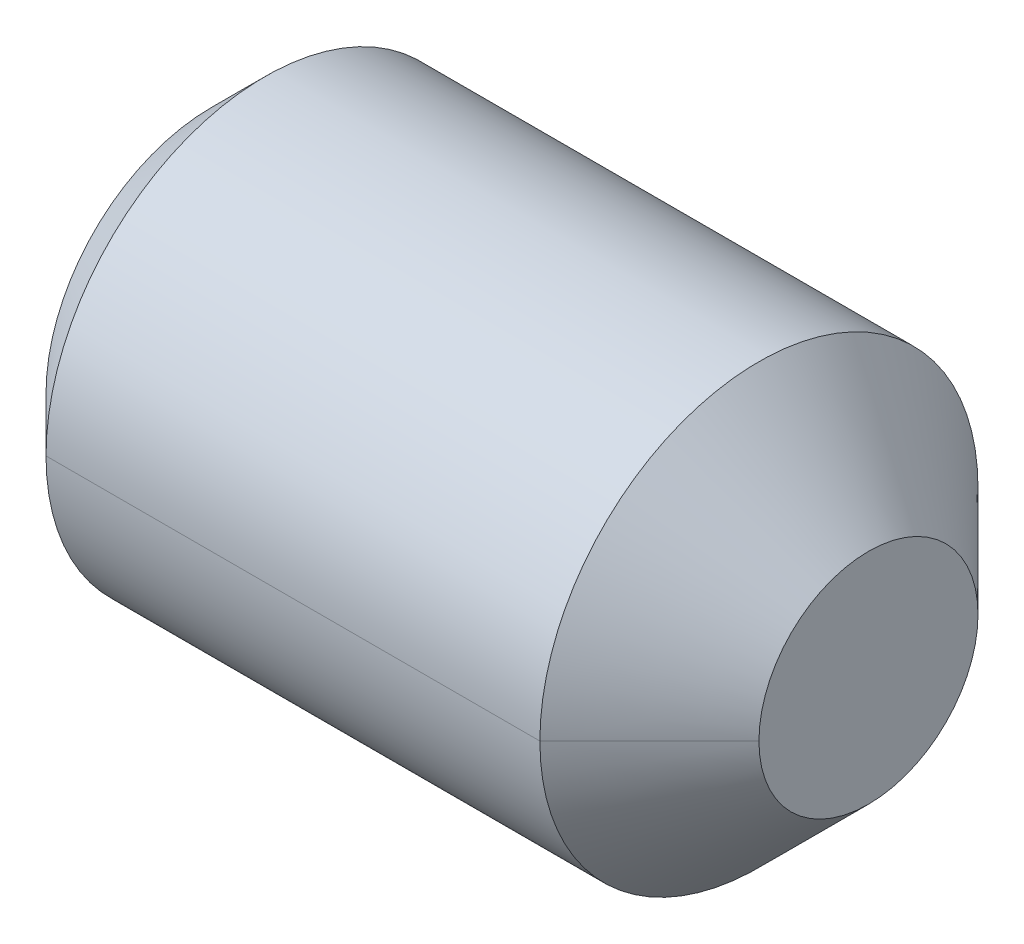
ISO-10303-21;
HEADER;
FILE_DESCRIPTION(('STEP AP214'),'2;1');
FILE_NAME('part.step','',(''),(''),'','','');
FILE_SCHEMA(('AUTOMOTIVE_DESIGN { 1 0 10303 214 1 1 1 1 }'));
ENDSEC;
DATA;
#1=APPLICATION_CONTEXT('core data for automotive mechanical design processes');
#2=APPLICATION_PROTOCOL_DEFINITION('international standard','automotive_design',2000,#1);
#3=PRODUCT_CONTEXT('',#1,'mechanical');
#4=PRODUCT('Part','Part','',(#3));
#5=PRODUCT_RELATED_PRODUCT_CATEGORY('part','',(#4));
#6=PRODUCT_DEFINITION_FORMATION('','',#4);
#7=PRODUCT_DEFINITION_CONTEXT('part definition',#1,'design');
#8=PRODUCT_DEFINITION('design','',#6,#7);
#9=PRODUCT_DEFINITION_SHAPE('','',#8);
#10=(LENGTH_UNIT() NAMED_UNIT(*) SI_UNIT(.MILLI.,.METRE.));
#11=(NAMED_UNIT(*) PLANE_ANGLE_UNIT() SI_UNIT($,.RADIAN.));
#12=(NAMED_UNIT(*) SI_UNIT($,.STERADIAN.) SOLID_ANGLE_UNIT());
#13=UNCERTAINTY_MEASURE_WITH_UNIT(LENGTH_MEASURE(1.E-05),#10,'distance_accuracy_value','');
#14=(GEOMETRIC_REPRESENTATION_CONTEXT(3) GLOBAL_UNCERTAINTY_ASSIGNED_CONTEXT((#13)) GLOBAL_UNIT_ASSIGNED_CONTEXT((#10,
#11,#12)) REPRESENTATION_CONTEXT('',''));
#15=CARTESIAN_POINT('',(0.,0.,0.));
#16=DIRECTION('',(0.,0.,1.));
#17=DIRECTION('',(1.,0.,0.));
#18=AXIS2_PLACEMENT_3D('',#15,#16,#17);
#19=CARTESIAN_POINT('',(-2.2,0.,0.));
#20=DIRECTION('',(-1.,0.,0.));
#21=DIRECTION('',(0.,0.,1.));
#22=AXIS2_PLACEMENT_3D('',#19,#20,#21);
#23=PLANE('',#22);
#24=DIRECTION('',(0.,0.866025403784439,0.499999999999999));
#25=VECTOR('',#24,1.);
#26=CARTESIAN_POINT('',(-2.2,-0.45,0.25980762113533));
#27=LINE('',#26,#25);
#28=CARTESIAN_POINT('',(-2.2,-0.45,0.25980762113533));
#29=VERTEX_POINT('',#28);
#30=CARTESIAN_POINT('',(-2.2,-0.225,0.389711431702996));
#31=VERTEX_POINT('',#30);
#32=EDGE_CURVE('E11',#29,#31,#27,.T.);
#33=ORIENTED_EDGE('',*,*,#32,.T.);
#34=CARTESIAN_POINT('',(-2.2,0.,0.));
#35=DIRECTION('',(1.,0.,0.));
#36=DIRECTION('',(0.,0.,1.));
#37=AXIS2_PLACEMENT_3D('',#34,#35,#36);
#38=CIRCLE('',#37,0.45);
#39=CARTESIAN_POINT('',(-2.2,-0.45,0.));
#40=VERTEX_POINT('',#39);
#41=EDGE_CURVE('E25',#31,#40,#38,.T.);
#42=ORIENTED_EDGE('',*,*,#41,.T.);
#43=DIRECTION('',(0.,0.,1.));
#44=VECTOR('',#43,1.);
#45=CARTESIAN_POINT('',(-2.2,-0.45,-0.25980762113533));
#46=LINE('',#45,#44);
#47=EDGE_CURVE('E333',#40,#29,#46,.T.);
#48=ORIENTED_EDGE('',*,*,#47,.T.);
#49=EDGE_LOOP('',(#33,#42,#48));
#50=FACE_BOUND('',#49,.T.);
#51=ADVANCED_FACE('F17',(#50),#23,.T.);
#52=CARTESIAN_POINT('',(-2.2,-0.45,-0.25980762113533));
#53=DIRECTION('',(0.,-1.,0.));
#54=DIRECTION('',(0.,0.,-1.));
#55=AXIS2_PLACEMENT_3D('',#52,#53,#54);
#56=PLANE('',#55);
#57=DIRECTION('',(0.,0.,1.));
#58=VECTOR('',#57,1.);
#59=CARTESIAN_POINT('',(-3.,-0.45,-0.25980762113533));
#60=LINE('',#59,#58);
#61=CARTESIAN_POINT('',(-3.,-0.45,-0.25980762113533));
#62=VERTEX_POINT('',#61);
#63=CARTESIAN_POINT('',(-3.,-0.45,0.25980762113533));
#64=VERTEX_POINT('',#63);
#65=EDGE_CURVE('E329',#62,#64,#60,.T.);
#66=ORIENTED_EDGE('',*,*,#65,.T.);
#67=DIRECTION('',(-1.,0.,0.));
#68=VECTOR('',#67,1.);
#69=CARTESIAN_POINT('',(-2.2,-0.45,0.25980762113533));
#70=LINE('',#69,#68);
#71=EDGE_CURVE('E324',#29,#64,#70,.T.);
#72=ORIENTED_EDGE('',*,*,#71,.F.);
#73=ORIENTED_EDGE('',*,*,#47,.F.);
#74=DIRECTION('',(0.,0.,1.));
#75=VECTOR('',#74,1.);
#76=CARTESIAN_POINT('',(-2.2,-0.45,-0.25980762113533));
#77=LINE('',#76,#75);
#78=CARTESIAN_POINT('',(-2.2,-0.45,-0.25980762113533));
#79=VERTEX_POINT('',#78);
#80=EDGE_CURVE('E319',#79,#40,#77,.T.);
#81=ORIENTED_EDGE('',*,*,#80,.F.);
#82=DIRECTION('',(-1.,0.,0.));
#83=VECTOR('',#82,1.);
#84=CARTESIAN_POINT('',(-2.2,-0.45,-0.25980762113533));
#85=LINE('',#84,#83);
#86=EDGE_CURVE('E315',#79,#62,#85,.T.);
#87=ORIENTED_EDGE('',*,*,#86,.T.);
#88=EDGE_LOOP('',(#66,#72,#73,#81,#87));
#89=FACE_BOUND('',#88,.T.);
#90=ADVANCED_FACE('F344',(#89),#56,.F.);
#91=CARTESIAN_POINT('',(-2.2,0.,-0.51961524227066));
#92=DIRECTION('',(0.,-0.499999999999999,-0.866025403784439));
#93=DIRECTION('',(0.,0.866025403784439,-0.499999999999999));
#94=AXIS2_PLACEMENT_3D('',#91,#92,#93);
#95=PLANE('',#94);
#96=DIRECTION('',(0.,-0.866025403784439,0.499999999999999));
#97=VECTOR('',#96,1.);
#98=CARTESIAN_POINT('',(-3.,0.,-0.51961524227066));
#99=LINE('',#98,#97);
#100=CARTESIAN_POINT('',(-3.,0.,-0.51961524227066));
#101=VERTEX_POINT('',#100);
#102=EDGE_CURVE('E310',#101,#62,#99,.T.);
#103=ORIENTED_EDGE('',*,*,#102,.T.);
#104=ORIENTED_EDGE('',*,*,#86,.F.);
#105=DIRECTION('',(0.,-0.866025403784439,0.499999999999999));
#106=VECTOR('',#105,1.);
#107=CARTESIAN_POINT('',(-2.2,0.,-0.51961524227066));
#108=LINE('',#107,#106);
#109=CARTESIAN_POINT('',(-2.2,-0.225,-0.389711431702998));
#110=VERTEX_POINT('',#109);
#111=EDGE_CURVE('E305',#110,#79,#108,.T.);
#112=ORIENTED_EDGE('',*,*,#111,.F.);
#113=DIRECTION('',(0.,-0.866025403784439,0.499999999999999));
#114=VECTOR('',#113,1.);
#115=CARTESIAN_POINT('',(-2.2,0.,-0.51961524227066));
#116=LINE('',#115,#114);
#117=CARTESIAN_POINT('',(-2.2,0.,-0.51961524227066));
#118=VERTEX_POINT('',#117);
#119=EDGE_CURVE('E300',#118,#110,#116,.T.);
#120=ORIENTED_EDGE('',*,*,#119,.F.);
#121=DIRECTION('',(-1.,0.,0.));
#122=VECTOR('',#121,1.);
#123=CARTESIAN_POINT('',(-2.2,0.,-0.51961524227066));
#124=LINE('',#123,#122);
#125=EDGE_CURVE('E296',#118,#101,#124,.T.);
#126=ORIENTED_EDGE('',*,*,#125,.T.);
#127=EDGE_LOOP('',(#103,#104,#112,#120,#126));
#128=FACE_BOUND('',#127,.T.);
#129=ADVANCED_FACE('F361',(#128),#95,.F.);
#130=CARTESIAN_POINT('',(-2.2,0.45,-0.25980762113533));
#131=DIRECTION('',(0.,0.499999999999999,-0.866025403784439));
#132=DIRECTION('',(0.,0.866025403784439,0.499999999999999));
#133=AXIS2_PLACEMENT_3D('',#130,#131,#132);
#134=PLANE('',#133);
#135=DIRECTION('',(0.,-0.866025403784439,-0.499999999999999));
#136=VECTOR('',#135,1.);
#137=CARTESIAN_POINT('',(-3.,0.45,-0.25980762113533));
#138=LINE('',#137,#136);
#139=CARTESIAN_POINT('',(-3.,0.45,-0.25980762113533));
#140=VERTEX_POINT('',#139);
#141=EDGE_CURVE('E291',#140,#101,#138,.T.);
#142=ORIENTED_EDGE('',*,*,#141,.T.);
#143=ORIENTED_EDGE('',*,*,#125,.F.);
#144=DIRECTION('',(0.,-0.866025403784439,-0.499999999999999));
#145=VECTOR('',#144,1.);
#146=CARTESIAN_POINT('',(-2.2,0.45,-0.25980762113533));
#147=LINE('',#146,#145);
#148=CARTESIAN_POINT('',(-2.2,0.225,-0.389711431702998));
#149=VERTEX_POINT('',#148);
#150=EDGE_CURVE('E286',#149,#118,#147,.T.);
#151=ORIENTED_EDGE('',*,*,#150,.F.);
#152=DIRECTION('',(0.,-0.866025403784439,-0.499999999999999));
#153=VECTOR('',#152,1.);
#154=CARTESIAN_POINT('',(-2.2,0.45,-0.25980762113533));
#155=LINE('',#154,#153);
#156=CARTESIAN_POINT('',(-2.2,0.45,-0.25980762113533));
#157=VERTEX_POINT('',#156);
#158=EDGE_CURVE('E281',#157,#149,#155,.T.);
#159=ORIENTED_EDGE('',*,*,#158,.F.);
#160=DIRECTION('',(-1.,0.,0.));
#161=VECTOR('',#160,1.);
#162=CARTESIAN_POINT('',(-2.2,0.45,-0.25980762113533));
#163=LINE('',#162,#161);
#164=EDGE_CURVE('E277',#157,#140,#163,.T.);
#165=ORIENTED_EDGE('',*,*,#164,.T.);
#166=EDGE_LOOP('',(#142,#143,#151,#159,#165));
#167=FACE_BOUND('',#166,.T.);
#168=ADVANCED_FACE('F383',(#167),#134,.F.);
#169=CARTESIAN_POINT('',(-2.2,0.45,0.25980762113533));
#170=DIRECTION('',(0.,1.,0.));
#171=DIRECTION('',(0.,0.,1.));
#172=AXIS2_PLACEMENT_3D('',#169,#170,#171);
#173=PLANE('',#172);
#174=DIRECTION('',(-1.,0.,0.));
#175=VECTOR('',#174,1.);
#176=CARTESIAN_POINT('',(-2.2,0.45,0.25980762113533));
#177=LINE('',#176,#175);
#178=CARTESIAN_POINT('',(-2.2,0.45,0.25980762113533));
#179=VERTEX_POINT('',#178);
#180=CARTESIAN_POINT('',(-3.,0.45,0.25980762113533));
#181=VERTEX_POINT('',#180);
#182=EDGE_CURVE('E273',#179,#181,#177,.T.);
#183=ORIENTED_EDGE('',*,*,#182,.T.);
#184=DIRECTION('',(0.,0.,1.));
#185=VECTOR('',#184,1.);
#186=CARTESIAN_POINT('',(-3.,0.45,0.));
#187=LINE('',#186,#185);
#188=EDGE_CURVE('E268',#140,#181,#187,.T.);
#189=ORIENTED_EDGE('',*,*,#188,.F.);
#190=ORIENTED_EDGE('',*,*,#164,.F.);
#191=DIRECTION('',(0.,0.,-1.));
#192=VECTOR('',#191,1.);
#193=CARTESIAN_POINT('',(-2.2,0.45,0.25980762113533));
#194=LINE('',#193,#192);
#195=CARTESIAN_POINT('',(-2.2,0.45,0.));
#196=VERTEX_POINT('',#195);
#197=EDGE_CURVE('E263',#196,#157,#194,.T.);
#198=ORIENTED_EDGE('',*,*,#197,.F.);
#199=DIRECTION('',(0.,0.,-1.));
#200=VECTOR('',#199,1.);
#201=CARTESIAN_POINT('',(-2.2,0.45,0.25980762113533));
#202=LINE('',#201,#200);
#203=EDGE_CURVE('E258',#179,#196,#202,.T.);
#204=ORIENTED_EDGE('',*,*,#203,.F.);
#205=EDGE_LOOP('',(#183,#189,#190,#198,#204));
#206=FACE_BOUND('',#205,.T.);
#207=ADVANCED_FACE('F386',(#206),#173,.F.);
#208=CARTESIAN_POINT('',(-2.2,0.,0.));
#209=DIRECTION('',(-1.,0.,0.));
#210=DIRECTION('',(0.,0.,1.));
#211=AXIS2_PLACEMENT_3D('',#208,#209,#210);
#212=PLANE('',#211);
#213=ORIENTED_EDGE('',*,*,#203,.T.);
#214=CARTESIAN_POINT('',(-2.2,0.,0.));
#215=DIRECTION('',(1.,0.,0.));
#216=DIRECTION('',(0.,0.,-1.));
#217=AXIS2_PLACEMENT_3D('',#214,#215,#216);
#218=CIRCLE('',#217,0.45);
#219=CARTESIAN_POINT('',(-2.2,0.225,0.389711431702998));
#220=VERTEX_POINT('',#219);
#221=EDGE_CURVE('E254',#196,#220,#218,.T.);
#222=ORIENTED_EDGE('',*,*,#221,.T.);
#223=DIRECTION('',(0.,0.866025403784439,-0.499999999999999));
#224=VECTOR('',#223,1.);
#225=CARTESIAN_POINT('',(-2.2,0.,0.51961524227066));
#226=LINE('',#225,#224);
#227=EDGE_CURVE('E249',#220,#179,#226,.T.);
#228=ORIENTED_EDGE('',*,*,#227,.T.);
#229=EDGE_LOOP('',(#213,#222,#228));
#230=FACE_BOUND('',#229,.T.);
#231=ADVANCED_FACE('F388',(#230),#212,.T.);
#232=CARTESIAN_POINT('',(-2.2,0.,0.51961524227066));
#233=DIRECTION('',(0.,0.499999999999999,0.866025403784439));
#234=DIRECTION('',(0.,-0.866025403784439,0.499999999999999));
#235=AXIS2_PLACEMENT_3D('',#232,#233,#234);
#236=PLANE('',#235);
#237=DIRECTION('',(0.,0.866025403784439,-0.499999999999999));
#238=VECTOR('',#237,1.);
#239=CARTESIAN_POINT('',(-3.,0.,0.51961524227066));
#240=LINE('',#239,#238);
#241=CARTESIAN_POINT('',(-3.,0.,0.51961524227066));
#242=VERTEX_POINT('',#241);
#243=EDGE_CURVE('E244',#242,#181,#240,.T.);
#244=ORIENTED_EDGE('',*,*,#243,.T.);
#245=ORIENTED_EDGE('',*,*,#182,.F.);
#246=ORIENTED_EDGE('',*,*,#227,.F.);
#247=DIRECTION('',(0.,0.866025403784439,-0.499999999999999));
#248=VECTOR('',#247,1.);
#249=CARTESIAN_POINT('',(-2.2,0.,0.51961524227066));
#250=LINE('',#249,#248);
#251=CARTESIAN_POINT('',(-2.2,0.,0.51961524227066));
#252=VERTEX_POINT('',#251);
#253=EDGE_CURVE('E239',#252,#220,#250,.T.);
#254=ORIENTED_EDGE('',*,*,#253,.F.);
#255=DIRECTION('',(-1.,0.,0.));
#256=VECTOR('',#255,1.);
#257=CARTESIAN_POINT('',(-2.2,0.,0.51961524227066));
#258=LINE('',#257,#256);
#259=EDGE_CURVE('E235',#252,#242,#258,.T.);
#260=ORIENTED_EDGE('',*,*,#259,.T.);
#261=EDGE_LOOP('',(#244,#245,#246,#254,#260));
#262=FACE_BOUND('',#261,.T.);
#263=ADVANCED_FACE('F370',(#262),#236,.F.);
#264=CARTESIAN_POINT('',(-2.2,-0.45,0.25980762113533));
#265=DIRECTION('',(0.,-0.499999999999999,0.866025403784439));
#266=DIRECTION('',(0.,-0.866025403784439,-0.499999999999999));
#267=AXIS2_PLACEMENT_3D('',#264,#265,#266);
#268=PLANE('',#267);
#269=DIRECTION('',(0.,0.866025403784439,0.499999999999999));
#270=VECTOR('',#269,1.);
#271=CARTESIAN_POINT('',(-3.,-0.45,0.25980762113533));
#272=LINE('',#271,#270);
#273=EDGE_CURVE('E230',#64,#242,#272,.T.);
#274=ORIENTED_EDGE('',*,*,#273,.T.);
#275=ORIENTED_EDGE('',*,*,#259,.F.);
#276=DIRECTION('',(0.,0.866025403784439,0.499999999999999));
#277=VECTOR('',#276,1.);
#278=CARTESIAN_POINT('',(-2.2,-0.45,0.25980762113533));
#279=LINE('',#278,#277);
#280=EDGE_CURVE('E225',#31,#252,#279,.T.);
#281=ORIENTED_EDGE('',*,*,#280,.F.);
#282=ORIENTED_EDGE('',*,*,#32,.F.);
#283=ORIENTED_EDGE('',*,*,#71,.T.);
#284=EDGE_LOOP('',(#274,#275,#281,#282,#283));
#285=FACE_BOUND('',#284,.T.);
#286=ADVANCED_FACE('F349',(#285),#268,.F.);
#287=CARTESIAN_POINT('',(-2.2,0.,0.));
#288=DIRECTION('',(-1.,0.,0.));
#289=DIRECTION('',(0.,0.,1.));
#290=AXIS2_PLACEMENT_3D('',#287,#288,#289);
#291=PLANE('',#290);
#292=ORIENTED_EDGE('',*,*,#253,.T.);
#293=CARTESIAN_POINT('',(-2.2,0.,0.));
#294=DIRECTION('',(1.,0.,0.));
#295=DIRECTION('',(0.,0.,1.));
#296=AXIS2_PLACEMENT_3D('',#293,#294,#295);
#297=CIRCLE('',#296,0.45);
#298=CARTESIAN_POINT('',(-2.2,0.,0.45));
#299=VERTEX_POINT('',#298);
#300=EDGE_CURVE('E221',#220,#299,#297,.T.);
#301=ORIENTED_EDGE('',*,*,#300,.T.);
#302=CARTESIAN_POINT('',(-2.2,0.,0.));
#303=DIRECTION('',(1.,0.,0.));
#304=DIRECTION('',(0.,0.,1.));
#305=AXIS2_PLACEMENT_3D('',#302,#303,#304);
#306=CIRCLE('',#305,0.45);
#307=EDGE_CURVE('E217',#299,#31,#306,.T.);
#308=ORIENTED_EDGE('',*,*,#307,.T.);
#309=ORIENTED_EDGE('',*,*,#280,.T.);
#310=EDGE_LOOP('',(#292,#301,#308,#309));
#311=FACE_BOUND('',#310,.T.);
#312=ADVANCED_FACE('F373',(#311),#291,.T.);
#313=CARTESIAN_POINT('',(-2.2,0.,0.));
#314=DIRECTION('',(-1.,0.,0.));
#315=DIRECTION('',(0.,1.,0.));
#316=AXIS2_PLACEMENT_3D('',#313,#314,#315);
#317=CONICAL_SURFACE('',#316,0.45,1.04719755119665);
#318=DIRECTION('',(-0.499999999999954,0.,-0.866025403784465));
#319=VECTOR('',#318,1.);
#320=CARTESIAN_POINT('',(-1.9401923788647,0.,0.));
#321=LINE('',#320,#319);
#322=CARTESIAN_POINT('',(-1.9401923788647,0.,0.));
#323=VERTEX_POINT('',#322);
#324=CARTESIAN_POINT('',(-2.2,0.,-0.45));
#325=VERTEX_POINT('',#324);
#326=EDGE_CURVE('E213',#323,#325,#321,.T.);
#327=ORIENTED_EDGE('',*,*,#326,.T.);
#328=CARTESIAN_POINT('',(-2.2,0.,0.));
#329=DIRECTION('',(1.,0.,0.));
#330=DIRECTION('',(0.,0.,1.));
#331=AXIS2_PLACEMENT_3D('',#328,#329,#330);
#332=CIRCLE('',#331,0.45);
#333=EDGE_CURVE('E208',#110,#325,#332,.T.);
#334=ORIENTED_EDGE('',*,*,#333,.F.);
#335=CARTESIAN_POINT('',(-2.2,0.,0.));
#336=DIRECTION('',(1.,0.,0.));
#337=DIRECTION('',(0.,0.,1.));
#338=AXIS2_PLACEMENT_3D('',#335,#336,#337);
#339=CIRCLE('',#338,0.45);
#340=EDGE_CURVE('E203',#40,#110,#339,.T.);
#341=ORIENTED_EDGE('',*,*,#340,.F.);
#342=ORIENTED_EDGE('',*,*,#41,.F.);
#343=ORIENTED_EDGE('',*,*,#307,.F.);
#344=DIRECTION('',(-0.499999999999954,0.,0.866025403784465));
#345=VECTOR('',#344,1.);
#346=CARTESIAN_POINT('',(-1.9401923788647,0.,0.));
#347=LINE('',#346,#345);
#348=EDGE_CURVE('E198',#323,#299,#347,.T.);
#349=ORIENTED_EDGE('',*,*,#348,.F.);
#350=EDGE_LOOP('',(#327,#334,#341,#342,#343,#349));
#351=FACE_BOUND('',#350,.T.);
#352=ADVANCED_FACE('F354',(#351),#317,.F.);
#353=CARTESIAN_POINT('',(-2.2,0.,0.));
#354=DIRECTION('',(-1.,0.,0.));
#355=DIRECTION('',(0.,-1.,0.));
#356=AXIS2_PLACEMENT_3D('',#353,#354,#355);
#357=CONICAL_SURFACE('',#356,0.45,1.04719755119665);
#358=ORIENTED_EDGE('',*,*,#348,.T.);
#359=ORIENTED_EDGE('',*,*,#300,.F.);
#360=ORIENTED_EDGE('',*,*,#221,.F.);
#361=CARTESIAN_POINT('',(-2.2,0.,0.));
#362=DIRECTION('',(1.,0.,0.));
#363=DIRECTION('',(0.,0.,1.));
#364=AXIS2_PLACEMENT_3D('',#361,#362,#363);
#365=CIRCLE('',#364,0.45);
#366=EDGE_CURVE('E193',#149,#196,#365,.T.);
#367=ORIENTED_EDGE('',*,*,#366,.F.);
#368=CARTESIAN_POINT('',(-2.2,0.,0.));
#369=DIRECTION('',(1.,0.,0.));
#370=DIRECTION('',(0.,0.,1.));
#371=AXIS2_PLACEMENT_3D('',#368,#369,#370);
#372=CIRCLE('',#371,0.45);
#373=EDGE_CURVE('E188',#325,#149,#372,.T.);
#374=ORIENTED_EDGE('',*,*,#373,.F.);
#375=ORIENTED_EDGE('',*,*,#326,.F.);
#376=EDGE_LOOP('',(#358,#359,#360,#367,#374,#375));
#377=FACE_BOUND('',#376,.T.);
#378=ADVANCED_FACE('F376',(#377),#357,.F.);
#379=CARTESIAN_POINT('',(-2.2,0.,0.));
#380=DIRECTION('',(-1.,0.,0.));
#381=DIRECTION('',(0.,0.,1.));
#382=AXIS2_PLACEMENT_3D('',#379,#380,#381);
#383=PLANE('',#382);
#384=ORIENTED_EDGE('',*,*,#119,.T.);
#385=ORIENTED_EDGE('',*,*,#333,.T.);
#386=ORIENTED_EDGE('',*,*,#373,.T.);
#387=ORIENTED_EDGE('',*,*,#150,.T.);
#388=EDGE_LOOP('',(#384,#385,#386,#387));
#389=FACE_BOUND('',#388,.T.);
#390=ADVANCED_FACE('F381',(#389),#383,.T.);
#391=CARTESIAN_POINT('',(-2.2,0.,0.));
#392=DIRECTION('',(-1.,0.,0.));
#393=DIRECTION('',(0.,0.,1.));
#394=AXIS2_PLACEMENT_3D('',#391,#392,#393);
#395=PLANE('',#394);
#396=ORIENTED_EDGE('',*,*,#158,.T.);
#397=ORIENTED_EDGE('',*,*,#366,.T.);
#398=ORIENTED_EDGE('',*,*,#197,.T.);
#399=EDGE_LOOP('',(#396,#397,#398));
#400=FACE_BOUND('',#399,.T.);
#401=ADVANCED_FACE('F479',(#400),#395,.T.);
#402=CARTESIAN_POINT('',(-2.2,0.,0.));
#403=DIRECTION('',(-1.,0.,0.));
#404=DIRECTION('',(0.,0.,1.));
#405=AXIS2_PLACEMENT_3D('',#402,#403,#404);
#406=PLANE('',#405);
#407=ORIENTED_EDGE('',*,*,#80,.T.);
#408=ORIENTED_EDGE('',*,*,#340,.T.);
#409=ORIENTED_EDGE('',*,*,#111,.T.);
#410=EDGE_LOOP('',(#407,#408,#409));
#411=FACE_BOUND('',#410,.T.);
#412=ADVANCED_FACE('F357',(#411),#406,.T.);
#413=CARTESIAN_POINT('',(-3.,0.,0.));
#414=DIRECTION('',(1.,0.,0.));
#415=DIRECTION('',(0.,0.,-1.));
#416=AXIS2_PLACEMENT_3D('',#413,#414,#415);
#417=PLANE('',#416);
#418=CARTESIAN_POINT('',(-3.,0.,0.));
#419=DIRECTION('',(1.,0.,0.));
#420=DIRECTION('',(0.,0.,-1.));
#421=AXIS2_PLACEMENT_3D('',#418,#419,#420);
#422=CIRCLE('',#421,0.7545);
#423=CARTESIAN_POINT('',(-3.,0.,0.7545));
#424=VERTEX_POINT('',#423);
#425=CARTESIAN_POINT('',(-3.,0.,-0.7545));
#426=VERTEX_POINT('',#425);
#427=EDGE_CURVE('E183',#424,#426,#422,.T.);
#428=ORIENTED_EDGE('',*,*,#427,.F.);
#429=CARTESIAN_POINT('',(-3.,0.,0.));
#430=DIRECTION('',(1.,0.,0.));
#431=DIRECTION('',(0.,0.,-1.));
#432=AXIS2_PLACEMENT_3D('',#429,#430,#431);
#433=CIRCLE('',#432,0.7545);
#434=EDGE_CURVE('E178',#426,#424,#433,.T.);
#435=ORIENTED_EDGE('',*,*,#434,.F.);
#436=EDGE_LOOP('',(#428,#435));
#437=FACE_BOUND('',#436,.T.);
#438=ORIENTED_EDGE('',*,*,#243,.F.);
#439=ORIENTED_EDGE('',*,*,#273,.F.);
#440=ORIENTED_EDGE('',*,*,#65,.F.);
#441=ORIENTED_EDGE('',*,*,#102,.F.);
#442=ORIENTED_EDGE('',*,*,#141,.F.);
#443=ORIENTED_EDGE('',*,*,#188,.T.);
#444=EDGE_LOOP('',(#438,#439,#440,#441,#442,#443));
#445=FACE_BOUND('',#444,.T.);
#446=ADVANCED_FACE('F366',(#437,#445),#417,.F.);
#447=CARTESIAN_POINT('',(-3.,0.,0.));
#448=DIRECTION('',(1.,0.,0.));
#449=DIRECTION('',(0.,-1.,0.));
#450=AXIS2_PLACEMENT_3D('',#447,#448,#449);
#451=CONICAL_SURFACE('',#450,0.7545,0.785398163397449);
#452=DIRECTION('',(0.707106781186547,0.,0.707106781186548));
#453=VECTOR('',#452,1.);
#454=CARTESIAN_POINT('',(-3.,0.,0.7545));
#455=LINE('',#454,#453);
#456=CARTESIAN_POINT('',(-2.7545,0.,1.));
#457=VERTEX_POINT('',#456);
#458=EDGE_CURVE('E174',#424,#457,#455,.T.);
#459=ORIENTED_EDGE('',*,*,#458,.T.);
#460=CARTESIAN_POINT('',(-2.7545,0.,0.));
#461=DIRECTION('',(1.,0.,0.));
#462=DIRECTION('',(0.,0.,-1.));
#463=AXIS2_PLACEMENT_3D('',#460,#461,#462);
#464=CIRCLE('',#463,1.);
#465=CARTESIAN_POINT('',(-2.7545,0.,-1.));
#466=VERTEX_POINT('',#465);
#467=EDGE_CURVE('E169',#466,#457,#464,.T.);
#468=ORIENTED_EDGE('',*,*,#467,.F.);
#469=DIRECTION('',(0.707106781186547,0.,-0.707106781186548));
#470=VECTOR('',#469,1.);
#471=CARTESIAN_POINT('',(-3.,0.,-0.7545));
#472=LINE('',#471,#470);
#473=EDGE_CURVE('E164',#426,#466,#472,.T.);
#474=ORIENTED_EDGE('',*,*,#473,.F.);
#475=ORIENTED_EDGE('',*,*,#434,.T.);
#476=EDGE_LOOP('',(#459,#468,#474,#475));
#477=FACE_BOUND('',#476,.T.);
#478=ADVANCED_FACE('F508',(#477),#451,.T.);
#479=CARTESIAN_POINT('',(-3.,0.,0.));
#480=DIRECTION('',(1.,0.,0.));
#481=DIRECTION('',(0.,1.,0.));
#482=AXIS2_PLACEMENT_3D('',#479,#480,#481);
#483=CONICAL_SURFACE('',#482,0.7545,0.785398163397449);
#484=ORIENTED_EDGE('',*,*,#458,.F.);
#485=ORIENTED_EDGE('',*,*,#427,.T.);
#486=ORIENTED_EDGE('',*,*,#473,.T.);
#487=CARTESIAN_POINT('',(-2.7545,0.,0.));
#488=DIRECTION('',(1.,0.,0.));
#489=DIRECTION('',(0.,0.,-1.));
#490=AXIS2_PLACEMENT_3D('',#487,#488,#489);
#491=CIRCLE('',#490,1.);
#492=EDGE_CURVE('E159',#457,#466,#491,.T.);
#493=ORIENTED_EDGE('',*,*,#492,.F.);
#494=EDGE_LOOP('',(#484,#485,#486,#493));
#495=FACE_BOUND('',#494,.T.);
#496=ADVANCED_FACE('F519',(#495),#483,.T.);
#497=CARTESIAN_POINT('',(0.,0.,0.));
#498=DIRECTION('',(1.,0.,0.));
#499=DIRECTION('',(0.,1.,0.));
#500=AXIS2_PLACEMENT_3D('',#497,#498,#499);
#501=CYLINDRICAL_SURFACE('',#500,1.);
#502=DIRECTION('',(1.,0.,0.));
#503=VECTOR('',#502,1.);
#504=CARTESIAN_POINT('',(-2.7545,0.,1.));
#505=LINE('',#504,#503);
#506=CARTESIAN_POINT('',(-0.5,0.,1.));
#507=VERTEX_POINT('',#506);
#508=EDGE_CURVE('E154',#457,#507,#505,.T.);
#509=ORIENTED_EDGE('',*,*,#508,.F.);
#510=ORIENTED_EDGE('',*,*,#492,.T.);
#511=DIRECTION('',(1.,0.,0.));
#512=VECTOR('',#511,1.);
#513=CARTESIAN_POINT('',(-2.7545,0.,-1.));
#514=LINE('',#513,#512);
#515=CARTESIAN_POINT('',(-0.5,0.,-1.));
#516=VERTEX_POINT('',#515);
#517=EDGE_CURVE('E150',#466,#516,#514,.T.);
#518=ORIENTED_EDGE('',*,*,#517,.T.);
#519=CARTESIAN_POINT('',(-0.5,0.,0.));
#520=DIRECTION('',(1.,0.,0.));
#521=DIRECTION('',(0.,0.,-1.));
#522=AXIS2_PLACEMENT_3D('',#519,#520,#521);
#523=CIRCLE('',#522,1.);
#524=EDGE_CURVE('E146',#507,#516,#523,.T.);
#525=ORIENTED_EDGE('',*,*,#524,.F.);
#526=EDGE_LOOP('',(#509,#510,#518,#525));
#527=FACE_BOUND('',#526,.T.);
#528=ADVANCED_FACE('F530',(#527),#501,.T.);
#529=CARTESIAN_POINT('',(-0.5,0.,0.));
#530=DIRECTION('',(-1.,0.,0.));
#531=DIRECTION('',(0.,1.,0.));
#532=AXIS2_PLACEMENT_3D('',#529,#530,#531);
#533=CONICAL_SURFACE('',#532,1.,0.785398163397448);
#534=DIRECTION('',(-0.707106781186548,0.,-0.707106781186547));
#535=VECTOR('',#534,1.);
#536=CARTESIAN_POINT('',(0.,0.,-0.5));
#537=LINE('',#536,#535);
#538=CARTESIAN_POINT('',(0.,0.,-0.5));
#539=VERTEX_POINT('',#538);
#540=EDGE_CURVE('E124',#539,#516,#537,.T.);
#541=ORIENTED_EDGE('',*,*,#540,.F.);
#542=CARTESIAN_POINT('',(0.,0.,0.));
#543=DIRECTION('',(1.,0.,0.));
#544=DIRECTION('',(0.,0.,-1.));
#545=AXIS2_PLACEMENT_3D('',#542,#543,#544);
#546=CIRCLE('',#545,0.5);
#547=CARTESIAN_POINT('',(0.,0.,0.5));
#548=VERTEX_POINT('',#547);
#549=EDGE_CURVE('E117',#548,#539,#546,.T.);
#550=ORIENTED_EDGE('',*,*,#549,.F.);
#551=DIRECTION('',(-0.707106781186548,0.,0.707106781186547));
#552=VECTOR('',#551,1.);
#553=CARTESIAN_POINT('',(0.,0.,0.5));
#554=LINE('',#553,#552);
#555=EDGE_CURVE('E122',#548,#507,#554,.T.);
#556=ORIENTED_EDGE('',*,*,#555,.T.);
#557=ORIENTED_EDGE('',*,*,#524,.T.);
#558=EDGE_LOOP('',(#541,#550,#556,#557));
#559=FACE_BOUND('',#558,.T.);
#560=ADVANCED_FACE('F119',(#559),#533,.T.);
#561=CARTESIAN_POINT('',(-0.5,0.,0.));
#562=DIRECTION('',(-1.,0.,0.));
#563=DIRECTION('',(0.,-1.,0.));
#564=AXIS2_PLACEMENT_3D('',#561,#562,#563);
#565=CONICAL_SURFACE('',#564,1.,0.785398163397448);
#566=ORIENTED_EDGE('',*,*,#540,.T.);
#567=CARTESIAN_POINT('',(-0.5,0.,0.));
#568=DIRECTION('',(1.,0.,0.));
#569=DIRECTION('',(0.,0.,-1.));
#570=AXIS2_PLACEMENT_3D('',#567,#568,#569);
#571=CIRCLE('',#570,1.);
#572=EDGE_CURVE('E131',#516,#507,#571,.T.);
#573=ORIENTED_EDGE('',*,*,#572,.T.);
#574=ORIENTED_EDGE('',*,*,#555,.F.);
#575=CARTESIAN_POINT('',(0.,0.,0.));
#576=DIRECTION('',(1.,0.,0.));
#577=DIRECTION('',(0.,0.,-1.));
#578=AXIS2_PLACEMENT_3D('',#575,#576,#577);
#579=CIRCLE('',#578,0.5);
#580=EDGE_CURVE('E128',#539,#548,#579,.T.);
#581=ORIENTED_EDGE('',*,*,#580,.F.);
#582=EDGE_LOOP('',(#566,#573,#574,#581));
#583=FACE_BOUND('',#582,.T.);
#584=ADVANCED_FACE('F134',(#583),#565,.T.);
#585=CARTESIAN_POINT('',(0.,0.5,0.));
#586=DIRECTION('',(-1.,0.,0.));
#587=DIRECTION('',(0.,0.,1.));
#588=AXIS2_PLACEMENT_3D('',#585,#586,#587);
#589=PLANE('',#588);
#590=ORIENTED_EDGE('',*,*,#580,.T.);
#591=ORIENTED_EDGE('',*,*,#549,.T.);
#592=EDGE_LOOP('',(#590,#591));
#593=FACE_BOUND('',#592,.T.);
#594=ADVANCED_FACE('F129',(#593),#589,.F.);
#595=CARTESIAN_POINT('',(0.,0.,0.));
#596=DIRECTION('',(1.,0.,0.));
#597=DIRECTION('',(0.,-1.,0.));
#598=AXIS2_PLACEMENT_3D('',#595,#596,#597);
#599=CYLINDRICAL_SURFACE('',#598,1.);
#600=ORIENTED_EDGE('',*,*,#508,.T.);
#601=ORIENTED_EDGE('',*,*,#572,.F.);
#602=ORIENTED_EDGE('',*,*,#517,.F.);
#603=ORIENTED_EDGE('',*,*,#467,.T.);
#604=EDGE_LOOP('',(#600,#601,#602,#603));
#605=FACE_BOUND('',#604,.T.);
#606=ADVANCED_FACE('F569',(#605),#599,.T.);
#607=CLOSED_SHELL('',(#51,#90,#129,#168,#207,#231,#263,#286,#312,#352,#378,#390,#401,#412,#446,
#478,#496,#528,#560,#584,#594,#606));
#608=MANIFOLD_SOLID_BREP('B1',#607);
#609=ADVANCED_BREP_SHAPE_REPRESENTATION('',(#18,#608),#14);
#610=SHAPE_DEFINITION_REPRESENTATION(#9,#609);
ENDSEC;
END-ISO-10303-21;
